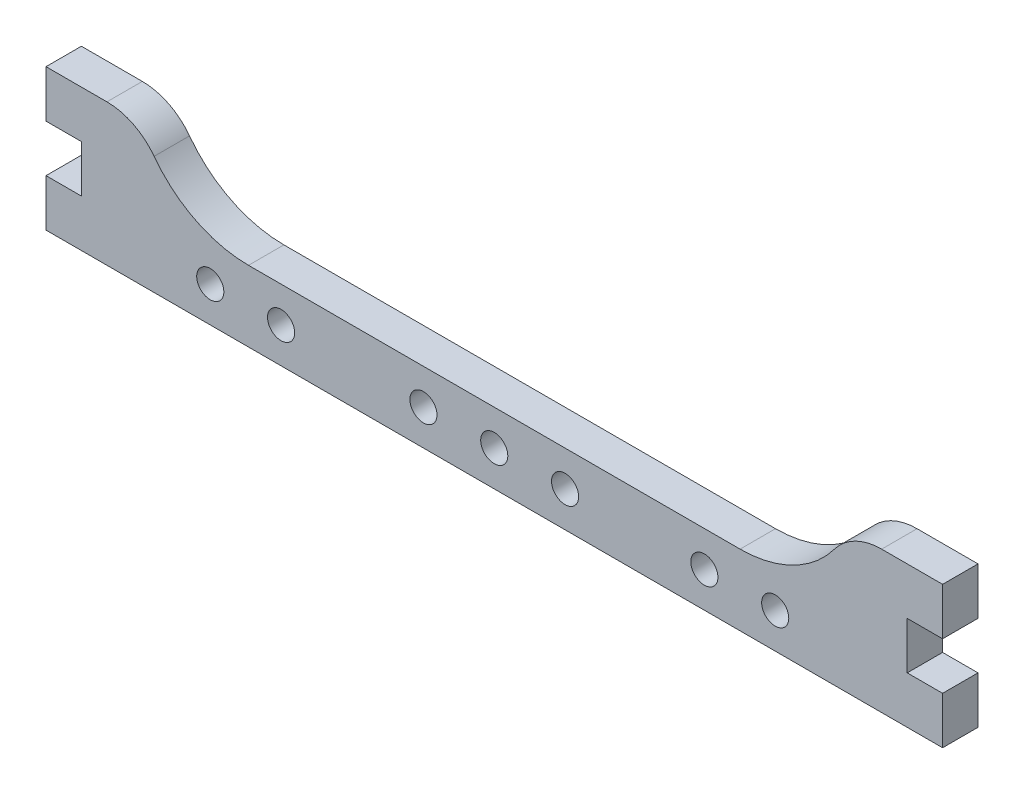
ISO-10303-21;
HEADER;
FILE_DESCRIPTION(('STEP AP214'),'2;1');
FILE_NAME('part.step','',(''),(''),'','','');
FILE_SCHEMA(('AUTOMOTIVE_DESIGN { 1 0 10303 214 1 1 1 1 }'));
ENDSEC;
DATA;
#1=APPLICATION_CONTEXT('core data for automotive mechanical design processes');
#2=APPLICATION_PROTOCOL_DEFINITION('international standard','automotive_design',2000,#1);
#3=PRODUCT_CONTEXT('',#1,'mechanical');
#4=PRODUCT('Part','Part','',(#3));
#5=PRODUCT_RELATED_PRODUCT_CATEGORY('part','',(#4));
#6=PRODUCT_DEFINITION_FORMATION('','',#4);
#7=PRODUCT_DEFINITION_CONTEXT('part definition',#1,'design');
#8=PRODUCT_DEFINITION('design','',#6,#7);
#9=PRODUCT_DEFINITION_SHAPE('','',#8);
#10=(LENGTH_UNIT() NAMED_UNIT(*) SI_UNIT(.MILLI.,.METRE.));
#11=(NAMED_UNIT(*) PLANE_ANGLE_UNIT() SI_UNIT($,.RADIAN.));
#12=(NAMED_UNIT(*) SI_UNIT($,.STERADIAN.) SOLID_ANGLE_UNIT());
#13=UNCERTAINTY_MEASURE_WITH_UNIT(LENGTH_MEASURE(1.E-05),#10,'distance_accuracy_value','');
#14=(GEOMETRIC_REPRESENTATION_CONTEXT(3) GLOBAL_UNCERTAINTY_ASSIGNED_CONTEXT((#13)) GLOBAL_UNIT_ASSIGNED_CONTEXT((#10,
#11,#12)) REPRESENTATION_CONTEXT('',''));
#15=CARTESIAN_POINT('',(0.,0.,0.));
#16=DIRECTION('',(0.,0.,1.));
#17=DIRECTION('',(1.,0.,0.));
#18=AXIS2_PLACEMENT_3D('',#15,#16,#17);
#19=CARTESIAN_POINT('',(-35.,12.,1.5));
#20=DIRECTION('',(0.,-1.,0.));
#21=DIRECTION('',(1.,0.,0.));
#22=AXIS2_PLACEMENT_3D('',#19,#20,#21);
#23=PLANE('',#22);
#24=DIRECTION('',(-1.,0.,0.));
#25=VECTOR('',#24,1.);
#26=CARTESIAN_POINT('',(-35.,12.,1.5));
#27=LINE('',#26,#25);
#28=CARTESIAN_POINT('',(-32.8348486100883,12.,1.5));
#29=VERTEX_POINT('',#28);
#30=CARTESIAN_POINT('',(-38.,12.,1.5));
#31=VERTEX_POINT('',#30);
#32=EDGE_CURVE('E271',#29,#31,#27,.T.);
#33=ORIENTED_EDGE('',*,*,#32,.F.);
#34=DIRECTION('',(0.,0.,1.));
#35=VECTOR('',#34,1.);
#36=CARTESIAN_POINT('',(-32.8348486100883,12.,1.5));
#37=LINE('',#36,#35);
#38=CARTESIAN_POINT('',(-32.8348486100883,12.,-1.5));
#39=VERTEX_POINT('',#38);
#40=EDGE_CURVE('E11',#29,#39,#37,.F.);
#41=ORIENTED_EDGE('',*,*,#40,.T.);
#42=DIRECTION('',(-1.,0.,0.));
#43=VECTOR('',#42,1.);
#44=CARTESIAN_POINT('',(-35.,12.,-1.5));
#45=LINE('',#44,#43);
#46=CARTESIAN_POINT('',(-38.,12.,-1.5));
#47=VERTEX_POINT('',#46);
#48=EDGE_CURVE('E167',#39,#47,#45,.T.);
#49=ORIENTED_EDGE('',*,*,#48,.T.);
#50=DIRECTION('',(0.,0.,1.));
#51=VECTOR('',#50,1.);
#52=CARTESIAN_POINT('',(-38.,12.,-1.5));
#53=LINE('',#52,#51);
#54=EDGE_CURVE('E170',#47,#31,#53,.T.);
#55=ORIENTED_EDGE('',*,*,#54,.T.);
#56=EDGE_LOOP('',(#33,#41,#49,#55));
#57=FACE_BOUND('',#56,.T.);
#58=ADVANCED_FACE('F39',(#57),#23,.F.);
#59=CARTESIAN_POINT('',(-35.,0.,1.5));
#60=DIRECTION('',(1.,0.,0.));
#61=DIRECTION('',(0.,0.,-1.));
#62=AXIS2_PLACEMENT_3D('',#59,#60,#61);
#63=PLANE('',#62);
#64=DIRECTION('',(0.,-1.,0.));
#65=VECTOR('',#64,1.);
#66=CARTESIAN_POINT('',(-35.,0.,1.5));
#67=LINE('',#66,#65);
#68=CARTESIAN_POINT('',(-35.,8.00000000000001,1.5));
#69=VERTEX_POINT('',#68);
#70=CARTESIAN_POINT('',(-35.,4.,1.5));
#71=VERTEX_POINT('',#70);
#72=EDGE_CURVE('E57',#69,#71,#67,.T.);
#73=ORIENTED_EDGE('',*,*,#72,.F.);
#74=DIRECTION('',(0.,0.,1.));
#75=VECTOR('',#74,1.);
#76=CARTESIAN_POINT('',(-35.,8.00000000000001,-1.5));
#77=LINE('',#76,#75);
#78=CARTESIAN_POINT('',(-35.,8.00000000000001,-1.5));
#79=VERTEX_POINT('',#78);
#80=EDGE_CURVE('E207',#79,#69,#77,.T.);
#81=ORIENTED_EDGE('',*,*,#80,.F.);
#82=DIRECTION('',(0.,-1.,0.));
#83=VECTOR('',#82,1.);
#84=CARTESIAN_POINT('',(-35.,0.,-1.5));
#85=LINE('',#84,#83);
#86=CARTESIAN_POINT('',(-35.,4.,-1.5));
#87=VERTEX_POINT('',#86);
#88=EDGE_CURVE('E246',#79,#87,#85,.T.);
#89=ORIENTED_EDGE('',*,*,#88,.T.);
#90=DIRECTION('',(0.,0.,1.));
#91=VECTOR('',#90,1.);
#92=CARTESIAN_POINT('',(-35.,4.,-1.5));
#93=LINE('',#92,#91);
#94=EDGE_CURVE('E217',#87,#71,#93,.T.);
#95=ORIENTED_EDGE('',*,*,#94,.T.);
#96=EDGE_LOOP('',(#73,#81,#89,#95));
#97=FACE_BOUND('',#96,.T.);
#98=ADVANCED_FACE('F431',(#97),#63,.F.);
#99=CARTESIAN_POINT('',(-35.,0.,1.5));
#100=DIRECTION('',(0.,1.,0.));
#101=DIRECTION('',(-1.,0.,0.));
#102=AXIS2_PLACEMENT_3D('',#99,#100,#101);
#103=PLANE('',#102);
#104=DIRECTION('',(1.,0.,0.));
#105=VECTOR('',#104,1.);
#106=CARTESIAN_POINT('',(-35.,0.,-1.5));
#107=LINE('',#106,#105);
#108=CARTESIAN_POINT('',(-38.,0.,-1.5));
#109=VERTEX_POINT('',#108);
#110=CARTESIAN_POINT('',(38.,0.,-1.5));
#111=VERTEX_POINT('',#110);
#112=EDGE_CURVE('E250',#109,#111,#107,.T.);
#113=ORIENTED_EDGE('',*,*,#112,.T.);
#114=DIRECTION('',(0.,0.,1.));
#115=VECTOR('',#114,1.);
#116=CARTESIAN_POINT('',(38.,0.,-1.5));
#117=LINE('',#116,#115);
#118=CARTESIAN_POINT('',(38.,0.,1.5));
#119=VERTEX_POINT('',#118);
#120=EDGE_CURVE('E345',#111,#119,#117,.T.);
#121=ORIENTED_EDGE('',*,*,#120,.T.);
#122=DIRECTION('',(1.,0.,0.));
#123=VECTOR('',#122,1.);
#124=CARTESIAN_POINT('',(-35.,0.,1.5));
#125=LINE('',#124,#123);
#126=CARTESIAN_POINT('',(-38.,0.,1.5));
#127=VERTEX_POINT('',#126);
#128=EDGE_CURVE('E272',#127,#119,#125,.T.);
#129=ORIENTED_EDGE('',*,*,#128,.F.);
#130=DIRECTION('',(0.,0.,1.));
#131=VECTOR('',#130,1.);
#132=CARTESIAN_POINT('',(-38.,0.,-1.5));
#133=LINE('',#132,#131);
#134=EDGE_CURVE('E223',#109,#127,#133,.T.);
#135=ORIENTED_EDGE('',*,*,#134,.F.);
#136=EDGE_LOOP('',(#113,#121,#129,#135));
#137=FACE_BOUND('',#136,.T.);
#138=ADVANCED_FACE('F436',(#137),#103,.F.);
#139=CARTESIAN_POINT('',(35.,0.,1.5));
#140=DIRECTION('',(-1.,0.,0.));
#141=DIRECTION('',(0.,0.,1.));
#142=AXIS2_PLACEMENT_3D('',#139,#140,#141);
#143=PLANE('',#142);
#144=DIRECTION('',(0.,1.,0.));
#145=VECTOR('',#144,1.);
#146=CARTESIAN_POINT('',(35.,0.,1.5));
#147=LINE('',#146,#145);
#148=CARTESIAN_POINT('',(35.,4.,1.5));
#149=VERTEX_POINT('',#148);
#150=CARTESIAN_POINT('',(35.,8.00000000000001,1.5));
#151=VERTEX_POINT('',#150);
#152=EDGE_CURVE('E269',#149,#151,#147,.T.);
#153=ORIENTED_EDGE('',*,*,#152,.F.);
#154=DIRECTION('',(0.,0.,1.));
#155=VECTOR('',#154,1.);
#156=CARTESIAN_POINT('',(35.,4.,-1.5));
#157=LINE('',#156,#155);
#158=CARTESIAN_POINT('',(35.,4.,-1.5));
#159=VERTEX_POINT('',#158);
#160=EDGE_CURVE('E316',#159,#149,#157,.T.);
#161=ORIENTED_EDGE('',*,*,#160,.F.);
#162=DIRECTION('',(0.,1.,0.));
#163=VECTOR('',#162,1.);
#164=CARTESIAN_POINT('',(35.,0.,-1.5));
#165=LINE('',#164,#163);
#166=CARTESIAN_POINT('',(35.,8.00000000000001,-1.5));
#167=VERTEX_POINT('',#166);
#168=EDGE_CURVE('E178',#159,#167,#165,.T.);
#169=ORIENTED_EDGE('',*,*,#168,.T.);
#170=DIRECTION('',(0.,0.,1.));
#171=VECTOR('',#170,1.);
#172=CARTESIAN_POINT('',(35.,8.00000000000001,-1.5));
#173=LINE('',#172,#171);
#174=EDGE_CURVE('E291',#167,#151,#173,.T.);
#175=ORIENTED_EDGE('',*,*,#174,.T.);
#176=EDGE_LOOP('',(#153,#161,#169,#175));
#177=FACE_BOUND('',#176,.T.);
#178=ADVANCED_FACE('F335',(#177),#143,.F.);
#179=CARTESIAN_POINT('',(38.,12.,-1.5));
#180=VERTEX_POINT('',#179);
#181=CARTESIAN_POINT('',(32.8348486100883,12.,-1.5));
#182=VERTEX_POINT('',#181);
#183=EDGE_CURVE('E177',#180,#182,#45,.T.);
#184=ORIENTED_EDGE('',*,*,#183,.T.);
#185=DIRECTION('',(0.,0.,-1.));
#186=VECTOR('',#185,1.);
#187=CARTESIAN_POINT('',(32.8348486100883,12.,1.5));
#188=LINE('',#187,#186);
#189=CARTESIAN_POINT('',(32.8348486100883,12.,1.5));
#190=VERTEX_POINT('',#189);
#191=EDGE_CURVE('E370',#182,#190,#188,.F.);
#192=ORIENTED_EDGE('',*,*,#191,.T.);
#193=CARTESIAN_POINT('',(38.,12.,1.5));
#194=VERTEX_POINT('',#193);
#195=EDGE_CURVE('E257',#194,#190,#27,.T.);
#196=ORIENTED_EDGE('',*,*,#195,.F.);
#197=DIRECTION('',(0.,0.,1.));
#198=VECTOR('',#197,1.);
#199=CARTESIAN_POINT('',(38.,12.,-1.5));
#200=LINE('',#199,#198);
#201=EDGE_CURVE('E282',#180,#194,#200,.T.);
#202=ORIENTED_EDGE('',*,*,#201,.F.);
#203=EDGE_LOOP('',(#184,#192,#196,#202));
#204=FACE_BOUND('',#203,.T.);
#205=ADVANCED_FACE('F369',(#204),#23,.F.);
#206=CARTESIAN_POINT('',(0.,0.,1.5));
#207=DIRECTION('',(0.,0.,-1.));
#208=DIRECTION('',(-1.,0.,0.));
#209=AXIS2_PLACEMENT_3D('',#206,#207,#208);
#210=PLANE('',#209);
#211=CARTESIAN_POINT('',(-24.0759562429866,2.99790958378771,1.5));
#212=DIRECTION('',(0.,0.,1.));
#213=DIRECTION('',(1.,0.,0.));
#214=AXIS2_PLACEMENT_3D('',#211,#212,#213);
#215=CIRCLE('',#214,1.15);
#216=CARTESIAN_POINT('',(-22.9259562429866,2.99790958378771,1.5));
#217=VERTEX_POINT('',#216);
#218=EDGE_CURVE('E520',#217,#217,#215,.T.);
#219=ORIENTED_EDGE('',*,*,#218,.F.);
#220=EDGE_LOOP('',(#219));
#221=FACE_BOUND('',#220,.T.);
#222=CARTESIAN_POINT('',(5.99818363191894,2.99789153114769,1.5));
#223=DIRECTION('',(0.,0.,1.));
#224=DIRECTION('',(1.,0.,0.));
#225=AXIS2_PLACEMENT_3D('',#222,#223,#224);
#226=CIRCLE('',#225,1.15);
#227=CARTESIAN_POINT('',(7.14818363191894,2.99789153114769,1.5));
#228=VERTEX_POINT('',#227);
#229=EDGE_CURVE('E537',#228,#228,#226,.T.);
#230=ORIENTED_EDGE('',*,*,#229,.F.);
#231=EDGE_LOOP('',(#230));
#232=FACE_BOUND('',#231,.T.);
#233=CARTESIAN_POINT('',(23.8098988836568,2.98731227019971,1.5));
#234=DIRECTION('',(0.,0.,1.));
#235=DIRECTION('',(1.,0.,0.));
#236=AXIS2_PLACEMENT_3D('',#233,#234,#235);
#237=CIRCLE('',#236,1.15);
#238=CARTESIAN_POINT('',(24.9598988836568,2.98731227019971,1.5));
#239=VERTEX_POINT('',#238);
#240=EDGE_CURVE('E533',#239,#239,#237,.T.);
#241=ORIENTED_EDGE('',*,*,#240,.F.);
#242=EDGE_LOOP('',(#241));
#243=FACE_BOUND('',#242,.T.);
#244=CARTESIAN_POINT('',(17.8061687344324,2.98942073905202,1.5));
#245=DIRECTION('',(0.,0.,1.));
#246=DIRECTION('',(1.,0.,0.));
#247=AXIS2_PLACEMENT_3D('',#244,#245,#246);
#248=CIRCLE('',#247,1.15);
#249=CARTESIAN_POINT('',(18.9561687344324,2.98942073905202,1.5));
#250=VERTEX_POINT('',#249);
#251=EDGE_CURVE('E202',#250,#250,#248,.T.);
#252=ORIENTED_EDGE('',*,*,#251,.F.);
#253=EDGE_LOOP('',(#252));
#254=FACE_BOUND('',#253,.T.);
#255=CARTESIAN_POINT('',(-0.00554651730550436,3.,1.5));
#256=DIRECTION('',(0.,0.,1.));
#257=DIRECTION('',(1.,0.,0.));
#258=AXIS2_PLACEMENT_3D('',#255,#256,#257);
#259=CIRCLE('',#258,1.15);
#260=CARTESIAN_POINT('',(1.1444534826945,3.,1.5));
#261=VERTEX_POINT('',#260);
#262=EDGE_CURVE('E543',#261,#261,#259,.T.);
#263=ORIENTED_EDGE('',*,*,#262,.F.);
#264=EDGE_LOOP('',(#263));
#265=FACE_BOUND('',#264,.T.);
#266=CARTESIAN_POINT('',(-6.00748816668952,2.99495443422052,1.5));
#267=DIRECTION('',(0.,0.,1.));
#268=DIRECTION('',(1.,0.,0.));
#269=AXIS2_PLACEMENT_3D('',#266,#267,#268);
#270=CIRCLE('',#269,1.15);
#271=CARTESIAN_POINT('',(-4.85748816668952,2.99495443422052,1.5));
#272=VERTEX_POINT('',#271);
#273=EDGE_CURVE('E530',#272,#272,#270,.T.);
#274=ORIENTED_EDGE('',*,*,#273,.F.);
#275=EDGE_LOOP('',(#274));
#276=FACE_BOUND('',#275,.T.);
#277=CARTESIAN_POINT('',(-18.0722260937621,2.9958011149354,1.5));
#278=DIRECTION('',(0.,0.,1.));
#279=DIRECTION('',(1.,0.,0.));
#280=AXIS2_PLACEMENT_3D('',#277,#278,#279);
#281=CIRCLE('',#280,1.15);
#282=CARTESIAN_POINT('',(-16.9222260937621,2.9958011149354,1.5));
#283=VERTEX_POINT('',#282);
#284=EDGE_CURVE('E523',#283,#283,#281,.T.);
#285=ORIENTED_EDGE('',*,*,#284,.F.);
#286=EDGE_LOOP('',(#285));
#287=FACE_BOUND('',#286,.T.);
#288=ORIENTED_EDGE('',*,*,#195,.T.);
#289=CARTESIAN_POINT('',(32.8348486100883,7.00000000000001,1.5));
#290=DIRECTION('',(0.,0.,-1.));
#291=DIRECTION('',(-1.,0.,0.));
#292=AXIS2_PLACEMENT_3D('',#289,#290,#291);
#293=CIRCLE('',#292,5.);
#294=CARTESIAN_POINT('',(28.8348486100883,10.,1.5));
#295=VERTEX_POINT('',#294);
#296=EDGE_CURVE('E390',#190,#295,#293,.F.);
#297=ORIENTED_EDGE('',*,*,#296,.T.);
#298=CARTESIAN_POINT('',(20.8348486100883,16.,1.5));
#299=DIRECTION('',(0.,0.,-1.));
#300=DIRECTION('',(-1.,0.,0.));
#301=AXIS2_PLACEMENT_3D('',#298,#299,#300);
#302=CIRCLE('',#301,10.);
#303=CARTESIAN_POINT('',(20.8348486100883,6.,1.5));
#304=VERTEX_POINT('',#303);
#305=EDGE_CURVE('E407',#295,#304,#302,.T.);
#306=ORIENTED_EDGE('',*,*,#305,.T.);
#307=DIRECTION('',(1.,0.,0.));
#308=VECTOR('',#307,1.);
#309=CARTESIAN_POINT('',(0.,6.,1.5));
#310=LINE('',#309,#308);
#311=CARTESIAN_POINT('',(-20.8348486100883,6.,1.5));
#312=VERTEX_POINT('',#311);
#313=EDGE_CURVE('E278',#312,#304,#310,.T.);
#314=ORIENTED_EDGE('',*,*,#313,.F.);
#315=CARTESIAN_POINT('',(-20.8348486100883,16.,1.5));
#316=DIRECTION('',(0.,0.,-1.));
#317=DIRECTION('',(-1.,0.,0.));
#318=AXIS2_PLACEMENT_3D('',#315,#316,#317);
#319=CIRCLE('',#318,10.);
#320=CARTESIAN_POINT('',(-28.8348486100883,10.,1.5));
#321=VERTEX_POINT('',#320);
#322=EDGE_CURVE('E398',#312,#321,#319,.T.);
#323=ORIENTED_EDGE('',*,*,#322,.T.);
#324=CARTESIAN_POINT('',(-32.8348486100883,7.,1.5));
#325=DIRECTION('',(0.,0.,-1.));
#326=DIRECTION('',(-1.,0.,0.));
#327=AXIS2_PLACEMENT_3D('',#324,#325,#326);
#328=CIRCLE('',#327,5.);
#329=EDGE_CURVE('E378',#321,#29,#328,.F.);
#330=ORIENTED_EDGE('',*,*,#329,.T.);
#331=ORIENTED_EDGE('',*,*,#32,.T.);
#332=DIRECTION('',(0.,-1.,0.));
#333=VECTOR('',#332,1.);
#334=CARTESIAN_POINT('',(-38.,12.,1.5));
#335=LINE('',#334,#333);
#336=CARTESIAN_POINT('',(-38.,8.00000000000001,1.5));
#337=VERTEX_POINT('',#336);
#338=EDGE_CURVE('E185',#31,#337,#335,.T.);
#339=ORIENTED_EDGE('',*,*,#338,.T.);
#340=DIRECTION('',(1.,0.,0.));
#341=VECTOR('',#340,1.);
#342=CARTESIAN_POINT('',(-35.,8.00000000000001,1.5));
#343=LINE('',#342,#341);
#344=EDGE_CURVE('E195',#337,#69,#343,.T.);
#345=ORIENTED_EDGE('',*,*,#344,.T.);
#346=ORIENTED_EDGE('',*,*,#72,.T.);
#347=DIRECTION('',(-1.,0.,0.));
#348=VECTOR('',#347,1.);
#349=CARTESIAN_POINT('',(-35.,4.,1.5));
#350=LINE('',#349,#348);
#351=CARTESIAN_POINT('',(-38.,4.,1.5));
#352=VERTEX_POINT('',#351);
#353=EDGE_CURVE('E210',#71,#352,#350,.T.);
#354=ORIENTED_EDGE('',*,*,#353,.T.);
#355=DIRECTION('',(0.,-1.,0.));
#356=VECTOR('',#355,1.);
#357=CARTESIAN_POINT('',(-38.,0.,1.5));
#358=LINE('',#357,#356);
#359=EDGE_CURVE('E219',#352,#127,#358,.T.);
#360=ORIENTED_EDGE('',*,*,#359,.T.);
#361=ORIENTED_EDGE('',*,*,#128,.T.);
#362=DIRECTION('',(0.,1.,0.));
#363=VECTOR('',#362,1.);
#364=CARTESIAN_POINT('',(38.,0.,1.5));
#365=LINE('',#364,#363);
#366=CARTESIAN_POINT('',(38.,4.,1.5));
#367=VERTEX_POINT('',#366);
#368=EDGE_CURVE('E227',#119,#367,#365,.T.);
#369=ORIENTED_EDGE('',*,*,#368,.T.);
#370=DIRECTION('',(-1.,0.,0.));
#371=VECTOR('',#370,1.);
#372=CARTESIAN_POINT('',(35.,4.,1.5));
#373=LINE('',#372,#371);
#374=EDGE_CURVE('E331',#367,#149,#373,.T.);
#375=ORIENTED_EDGE('',*,*,#374,.T.);
#376=ORIENTED_EDGE('',*,*,#152,.T.);
#377=DIRECTION('',(1.,0.,0.));
#378=VECTOR('',#377,1.);
#379=CARTESIAN_POINT('',(35.,8.00000000000001,1.5));
#380=LINE('',#379,#378);
#381=CARTESIAN_POINT('',(38.,8.00000000000001,1.5));
#382=VERTEX_POINT('',#381);
#383=EDGE_CURVE('E310',#151,#382,#380,.T.);
#384=ORIENTED_EDGE('',*,*,#383,.T.);
#385=DIRECTION('',(0.,1.,0.));
#386=VECTOR('',#385,1.);
#387=CARTESIAN_POINT('',(38.,12.,1.5));
#388=LINE('',#387,#386);
#389=EDGE_CURVE('E301',#382,#194,#388,.T.);
#390=ORIENTED_EDGE('',*,*,#389,.T.);
#391=EDGE_LOOP('',(#288,#297,#306,#314,#323,#330,#331,#339,#345,#346,#354,#360,#361,#369,#375,
#376,#384,#390));
#392=FACE_BOUND('',#391,.T.);
#393=ADVANCED_FACE('F327',(#221,#232,#243,#254,#265,#276,#287,#392),#210,.F.);
#394=CARTESIAN_POINT('',(0.,0.,-1.5));
#395=DIRECTION('',(0.,0.,-1.));
#396=DIRECTION('',(-1.,0.,0.));
#397=AXIS2_PLACEMENT_3D('',#394,#395,#396);
#398=PLANE('',#397);
#399=CARTESIAN_POINT('',(-24.0759562429866,2.99790958378771,-1.5));
#400=DIRECTION('',(0.,0.,-1.));
#401=DIRECTION('',(-1.,0.,0.));
#402=AXIS2_PLACEMENT_3D('',#399,#400,#401);
#403=CIRCLE('',#402,1.15);
#404=CARTESIAN_POINT('',(-25.2259562429866,2.99790958378771,-1.5));
#405=VERTEX_POINT('',#404);
#406=EDGE_CURVE('E43',#405,#405,#403,.T.);
#407=ORIENTED_EDGE('',*,*,#406,.F.);
#408=EDGE_LOOP('',(#407));
#409=FACE_BOUND('',#408,.T.);
#410=CARTESIAN_POINT('',(5.99818363191894,2.99789153114769,-1.5));
#411=DIRECTION('',(0.,0.,-1.));
#412=DIRECTION('',(-1.,0.,0.));
#413=AXIS2_PLACEMENT_3D('',#410,#411,#412);
#414=CIRCLE('',#413,1.15);
#415=CARTESIAN_POINT('',(4.84818363191894,2.99789153114769,-1.5));
#416=VERTEX_POINT('',#415);
#417=EDGE_CURVE('E582',#416,#416,#414,.T.);
#418=ORIENTED_EDGE('',*,*,#417,.F.);
#419=EDGE_LOOP('',(#418));
#420=FACE_BOUND('',#419,.T.);
#421=CARTESIAN_POINT('',(23.8098988836568,2.98731227019971,-1.5));
#422=DIRECTION('',(0.,0.,-1.));
#423=DIRECTION('',(-1.,0.,0.));
#424=AXIS2_PLACEMENT_3D('',#421,#422,#423);
#425=CIRCLE('',#424,1.15);
#426=CARTESIAN_POINT('',(22.6598988836568,2.98731227019971,-1.5));
#427=VERTEX_POINT('',#426);
#428=EDGE_CURVE('E579',#427,#427,#425,.T.);
#429=ORIENTED_EDGE('',*,*,#428,.F.);
#430=EDGE_LOOP('',(#429));
#431=FACE_BOUND('',#430,.T.);
#432=CARTESIAN_POINT('',(17.8061687344324,2.98942073905202,-1.5));
#433=DIRECTION('',(0.,0.,-1.));
#434=DIRECTION('',(-1.,0.,0.));
#435=AXIS2_PLACEMENT_3D('',#432,#433,#434);
#436=CIRCLE('',#435,1.15);
#437=CARTESIAN_POINT('',(16.6561687344324,2.98942073905202,-1.5));
#438=VERTEX_POINT('',#437);
#439=EDGE_CURVE('E575',#438,#438,#436,.T.);
#440=ORIENTED_EDGE('',*,*,#439,.F.);
#441=EDGE_LOOP('',(#440));
#442=FACE_BOUND('',#441,.T.);
#443=CARTESIAN_POINT('',(-0.00554651730550436,3.,-1.5));
#444=DIRECTION('',(0.,0.,-1.));
#445=DIRECTION('',(-1.,0.,0.));
#446=AXIS2_PLACEMENT_3D('',#443,#444,#445);
#447=CIRCLE('',#446,1.15);
#448=CARTESIAN_POINT('',(-1.1555465173055,3.,-1.5));
#449=VERTEX_POINT('',#448);
#450=EDGE_CURVE('E569',#449,#449,#447,.T.);
#451=ORIENTED_EDGE('',*,*,#450,.F.);
#452=EDGE_LOOP('',(#451));
#453=FACE_BOUND('',#452,.T.);
#454=CARTESIAN_POINT('',(-6.00748816668952,2.99495443422052,-1.5));
#455=DIRECTION('',(0.,0.,-1.));
#456=DIRECTION('',(-1.,0.,0.));
#457=AXIS2_PLACEMENT_3D('',#454,#455,#456);
#458=CIRCLE('',#457,1.15);
#459=CARTESIAN_POINT('',(-7.15748816668952,2.99495443422052,-1.5));
#460=VERTEX_POINT('',#459);
#461=EDGE_CURVE('E528',#460,#460,#458,.T.);
#462=ORIENTED_EDGE('',*,*,#461,.F.);
#463=EDGE_LOOP('',(#462));
#464=FACE_BOUND('',#463,.T.);
#465=CARTESIAN_POINT('',(-18.0722260937621,2.9958011149354,-1.5));
#466=DIRECTION('',(0.,0.,-1.));
#467=DIRECTION('',(-1.,0.,0.));
#468=AXIS2_PLACEMENT_3D('',#465,#466,#467);
#469=CIRCLE('',#468,1.15);
#470=CARTESIAN_POINT('',(-19.2222260937621,2.9958011149354,-1.5));
#471=VERTEX_POINT('',#470);
#472=EDGE_CURVE('E522',#471,#471,#469,.T.);
#473=ORIENTED_EDGE('',*,*,#472,.F.);
#474=EDGE_LOOP('',(#473));
#475=FACE_BOUND('',#474,.T.);
#476=CARTESIAN_POINT('',(20.8348486100883,16.,-1.5));
#477=DIRECTION('',(0.,0.,-1.));
#478=DIRECTION('',(-1.,0.,0.));
#479=AXIS2_PLACEMENT_3D('',#476,#477,#478);
#480=CIRCLE('',#479,10.);
#481=CARTESIAN_POINT('',(20.8348486100883,6.,-1.5));
#482=VERTEX_POINT('',#481);
#483=CARTESIAN_POINT('',(28.8348486100883,10.,-1.5));
#484=VERTEX_POINT('',#483);
#485=EDGE_CURVE('E402',#482,#484,#480,.F.);
#486=ORIENTED_EDGE('',*,*,#485,.T.);
#487=CARTESIAN_POINT('',(32.8348486100883,7.00000000000001,-1.5));
#488=DIRECTION('',(0.,0.,-1.));
#489=DIRECTION('',(-1.,0.,0.));
#490=AXIS2_PLACEMENT_3D('',#487,#488,#489);
#491=CIRCLE('',#490,5.);
#492=EDGE_CURVE('E364',#484,#182,#491,.T.);
#493=ORIENTED_EDGE('',*,*,#492,.T.);
#494=ORIENTED_EDGE('',*,*,#183,.F.);
#495=DIRECTION('',(0.,1.,0.));
#496=VECTOR('',#495,1.);
#497=CARTESIAN_POINT('',(38.,12.,-1.5));
#498=LINE('',#497,#496);
#499=CARTESIAN_POINT('',(38.,8.00000000000001,-1.5));
#500=VERTEX_POINT('',#499);
#501=EDGE_CURVE('E295',#500,#180,#498,.T.);
#502=ORIENTED_EDGE('',*,*,#501,.F.);
#503=DIRECTION('',(1.,0.,0.));
#504=VECTOR('',#503,1.);
#505=CARTESIAN_POINT('',(35.,8.00000000000001,-1.5));
#506=LINE('',#505,#504);
#507=EDGE_CURVE('E298',#167,#500,#506,.T.);
#508=ORIENTED_EDGE('',*,*,#507,.F.);
#509=ORIENTED_EDGE('',*,*,#168,.F.);
#510=DIRECTION('',(-1.,0.,0.));
#511=VECTOR('',#510,1.);
#512=CARTESIAN_POINT('',(35.,4.,-1.5));
#513=LINE('',#512,#511);
#514=CARTESIAN_POINT('',(38.,4.,-1.5));
#515=VERTEX_POINT('',#514);
#516=EDGE_CURVE('E340',#515,#159,#513,.T.);
#517=ORIENTED_EDGE('',*,*,#516,.F.);
#518=DIRECTION('',(0.,1.,0.));
#519=VECTOR('',#518,1.);
#520=CARTESIAN_POINT('',(38.,0.,-1.5));
#521=LINE('',#520,#519);
#522=EDGE_CURVE('E233',#111,#515,#521,.T.);
#523=ORIENTED_EDGE('',*,*,#522,.F.);
#524=ORIENTED_EDGE('',*,*,#112,.F.);
#525=DIRECTION('',(0.,-1.,0.));
#526=VECTOR('',#525,1.);
#527=CARTESIAN_POINT('',(-38.,0.,-1.5));
#528=LINE('',#527,#526);
#529=CARTESIAN_POINT('',(-38.,4.,-1.5));
#530=VERTEX_POINT('',#529);
#531=EDGE_CURVE('E213',#530,#109,#528,.T.);
#532=ORIENTED_EDGE('',*,*,#531,.F.);
#533=DIRECTION('',(-1.,0.,0.));
#534=VECTOR('',#533,1.);
#535=CARTESIAN_POINT('',(-35.,4.,-1.5));
#536=LINE('',#535,#534);
#537=EDGE_CURVE('E218',#87,#530,#536,.T.);
#538=ORIENTED_EDGE('',*,*,#537,.F.);
#539=ORIENTED_EDGE('',*,*,#88,.F.);
#540=DIRECTION('',(1.,0.,0.));
#541=VECTOR('',#540,1.);
#542=CARTESIAN_POINT('',(-35.,8.00000000000001,-1.5));
#543=LINE('',#542,#541);
#544=CARTESIAN_POINT('',(-38.,8.00000000000001,-1.5));
#545=VERTEX_POINT('',#544);
#546=EDGE_CURVE('E188',#545,#79,#543,.T.);
#547=ORIENTED_EDGE('',*,*,#546,.F.);
#548=DIRECTION('',(0.,-1.,0.));
#549=VECTOR('',#548,1.);
#550=CARTESIAN_POINT('',(-38.,12.,-1.5));
#551=LINE('',#550,#549);
#552=EDGE_CURVE('E183',#47,#545,#551,.T.);
#553=ORIENTED_EDGE('',*,*,#552,.F.);
#554=ORIENTED_EDGE('',*,*,#48,.F.);
#555=CARTESIAN_POINT('',(-32.8348486100883,7.,-1.5));
#556=DIRECTION('',(0.,0.,-1.));
#557=DIRECTION('',(-1.,0.,0.));
#558=AXIS2_PLACEMENT_3D('',#555,#556,#557);
#559=CIRCLE('',#558,5.);
#560=CARTESIAN_POINT('',(-28.8348486100883,10.,-1.5));
#561=VERTEX_POINT('',#560);
#562=EDGE_CURVE('E382',#39,#561,#559,.T.);
#563=ORIENTED_EDGE('',*,*,#562,.T.);
#564=CARTESIAN_POINT('',(-20.8348486100883,16.,-1.5));
#565=DIRECTION('',(0.,0.,-1.));
#566=DIRECTION('',(-1.,0.,0.));
#567=AXIS2_PLACEMENT_3D('',#564,#565,#566);
#568=CIRCLE('',#567,10.);
#569=CARTESIAN_POINT('',(-20.8348486100883,6.,-1.5));
#570=VERTEX_POINT('',#569);
#571=EDGE_CURVE('E399',#561,#570,#568,.F.);
#572=ORIENTED_EDGE('',*,*,#571,.T.);
#573=DIRECTION('',(1.,0.,0.));
#574=VECTOR('',#573,1.);
#575=CARTESIAN_POINT('',(0.,6.,-1.5));
#576=LINE('',#575,#574);
#577=EDGE_CURVE('E251',#570,#482,#576,.T.);
#578=ORIENTED_EDGE('',*,*,#577,.T.);
#579=EDGE_LOOP('',(#486,#493,#494,#502,#508,#509,#517,#523,#524,#532,#538,#539,#547,#553,#554,
#563,#572,#578));
#580=FACE_BOUND('',#579,.T.);
#581=ADVANCED_FACE('F192',(#409,#420,#431,#442,#453,#464,#475,#580),#398,.T.);
#582=CARTESIAN_POINT('',(0.,6.,-1.5));
#583=DIRECTION('',(0.,-1.,0.));
#584=DIRECTION('',(0.,0.,-1.));
#585=AXIS2_PLACEMENT_3D('',#582,#583,#584);
#586=PLANE('',#585);
#587=ORIENTED_EDGE('',*,*,#313,.T.);
#588=DIRECTION('',(0.,0.,-1.));
#589=VECTOR('',#588,1.);
#590=CARTESIAN_POINT('',(20.8348486100883,6.,-1.5));
#591=LINE('',#590,#589);
#592=EDGE_CURVE('E376',#304,#482,#591,.T.);
#593=ORIENTED_EDGE('',*,*,#592,.T.);
#594=ORIENTED_EDGE('',*,*,#577,.F.);
#595=DIRECTION('',(0.,0.,1.));
#596=VECTOR('',#595,1.);
#597=CARTESIAN_POINT('',(-20.8348486100883,6.,-1.5));
#598=LINE('',#597,#596);
#599=EDGE_CURVE('E372',#570,#312,#598,.T.);
#600=ORIENTED_EDGE('',*,*,#599,.T.);
#601=EDGE_LOOP('',(#587,#593,#594,#600));
#602=FACE_BOUND('',#601,.T.);
#603=ADVANCED_FACE('F453',(#602),#586,.F.);
#604=CARTESIAN_POINT('',(20.8348486100883,16.,-1.5));
#605=DIRECTION('',(0.,0.,-1.));
#606=DIRECTION('',(-1.,0.,0.));
#607=AXIS2_PLACEMENT_3D('',#604,#605,#606);
#608=CYLINDRICAL_SURFACE('',#607,10.);
#609=ORIENTED_EDGE('',*,*,#305,.F.);
#610=DIRECTION('',(0.,0.,-1.));
#611=VECTOR('',#610,1.);
#612=CARTESIAN_POINT('',(28.8348486100883,10.,-1.5));
#613=LINE('',#612,#611);
#614=EDGE_CURVE('E385',#295,#484,#613,.T.);
#615=ORIENTED_EDGE('',*,*,#614,.T.);
#616=ORIENTED_EDGE('',*,*,#485,.F.);
#617=ORIENTED_EDGE('',*,*,#592,.F.);
#618=EDGE_LOOP('',(#609,#615,#616,#617));
#619=FACE_BOUND('',#618,.T.);
#620=ADVANCED_FACE('F420',(#619),#608,.F.);
#621=CARTESIAN_POINT('',(-20.8348486100883,16.,-1.5));
#622=DIRECTION('',(0.,0.,1.));
#623=DIRECTION('',(1.,0.,0.));
#624=AXIS2_PLACEMENT_3D('',#621,#622,#623);
#625=CYLINDRICAL_SURFACE('',#624,10.);
#626=ORIENTED_EDGE('',*,*,#571,.F.);
#627=DIRECTION('',(0.,0.,1.));
#628=VECTOR('',#627,1.);
#629=CARTESIAN_POINT('',(-28.8348486100883,10.,-1.5));
#630=LINE('',#629,#628);
#631=EDGE_CURVE('E49',#561,#321,#630,.T.);
#632=ORIENTED_EDGE('',*,*,#631,.T.);
#633=ORIENTED_EDGE('',*,*,#322,.F.);
#634=ORIENTED_EDGE('',*,*,#599,.F.);
#635=EDGE_LOOP('',(#626,#632,#633,#634));
#636=FACE_BOUND('',#635,.T.);
#637=ADVANCED_FACE('F396',(#636),#625,.F.);
#638=CARTESIAN_POINT('',(32.8348486100883,7.00000000000001,-1.5));
#639=DIRECTION('',(0.,0.,-1.));
#640=DIRECTION('',(-1.,0.,0.));
#641=AXIS2_PLACEMENT_3D('',#638,#639,#640);
#642=CYLINDRICAL_SURFACE('',#641,5.);
#643=ORIENTED_EDGE('',*,*,#492,.F.);
#644=ORIENTED_EDGE('',*,*,#614,.F.);
#645=ORIENTED_EDGE('',*,*,#296,.F.);
#646=ORIENTED_EDGE('',*,*,#191,.F.);
#647=EDGE_LOOP('',(#643,#644,#645,#646));
#648=FACE_BOUND('',#647,.T.);
#649=ADVANCED_FACE('F423',(#648),#642,.T.);
#650=CARTESIAN_POINT('',(-32.8348486100883,7.,-1.5));
#651=DIRECTION('',(0.,0.,1.));
#652=DIRECTION('',(1.,0.,0.));
#653=AXIS2_PLACEMENT_3D('',#650,#651,#652);
#654=CYLINDRICAL_SURFACE('',#653,5.);
#655=ORIENTED_EDGE('',*,*,#562,.F.);
#656=ORIENTED_EDGE('',*,*,#40,.F.);
#657=ORIENTED_EDGE('',*,*,#329,.F.);
#658=ORIENTED_EDGE('',*,*,#631,.F.);
#659=EDGE_LOOP('',(#655,#656,#657,#658));
#660=FACE_BOUND('',#659,.T.);
#661=ADVANCED_FACE('F41',(#660),#654,.T.);
#662=CARTESIAN_POINT('',(38.,12.,-1.5));
#663=DIRECTION('',(1.,0.,0.));
#664=DIRECTION('',(0.,0.,-1.));
#665=AXIS2_PLACEMENT_3D('',#662,#663,#664);
#666=PLANE('',#665);
#667=ORIENTED_EDGE('',*,*,#389,.F.);
#668=DIRECTION('',(0.,0.,1.));
#669=VECTOR('',#668,1.);
#670=CARTESIAN_POINT('',(38.,8.00000000000001,-1.5));
#671=LINE('',#670,#669);
#672=EDGE_CURVE('E288',#500,#382,#671,.T.);
#673=ORIENTED_EDGE('',*,*,#672,.F.);
#674=ORIENTED_EDGE('',*,*,#501,.T.);
#675=ORIENTED_EDGE('',*,*,#201,.T.);
#676=EDGE_LOOP('',(#667,#673,#674,#675));
#677=FACE_BOUND('',#676,.T.);
#678=ADVANCED_FACE('F326',(#677),#666,.T.);
#679=CARTESIAN_POINT('',(35.,8.00000000000001,-1.5));
#680=DIRECTION('',(0.,-1.,0.));
#681=DIRECTION('',(1.,0.,0.));
#682=AXIS2_PLACEMENT_3D('',#679,#680,#681);
#683=PLANE('',#682);
#684=ORIENTED_EDGE('',*,*,#383,.F.);
#685=ORIENTED_EDGE('',*,*,#174,.F.);
#686=ORIENTED_EDGE('',*,*,#507,.T.);
#687=ORIENTED_EDGE('',*,*,#672,.T.);
#688=EDGE_LOOP('',(#684,#685,#686,#687));
#689=FACE_BOUND('',#688,.T.);
#690=ADVANCED_FACE('F324',(#689),#683,.T.);
#691=CARTESIAN_POINT('',(35.,4.,-1.5));
#692=DIRECTION('',(0.,1.,0.));
#693=DIRECTION('',(0.,0.,1.));
#694=AXIS2_PLACEMENT_3D('',#691,#692,#693);
#695=PLANE('',#694);
#696=ORIENTED_EDGE('',*,*,#374,.F.);
#697=DIRECTION('',(0.,0.,1.));
#698=VECTOR('',#697,1.);
#699=CARTESIAN_POINT('',(38.,4.,-1.5));
#700=LINE('',#699,#698);
#701=EDGE_CURVE('E342',#515,#367,#700,.T.);
#702=ORIENTED_EDGE('',*,*,#701,.F.);
#703=ORIENTED_EDGE('',*,*,#516,.T.);
#704=ORIENTED_EDGE('',*,*,#160,.T.);
#705=EDGE_LOOP('',(#696,#702,#703,#704));
#706=FACE_BOUND('',#705,.T.);
#707=ADVANCED_FACE('F338',(#706),#695,.T.);
#708=CARTESIAN_POINT('',(38.,0.,-1.5));
#709=DIRECTION('',(1.,0.,0.));
#710=DIRECTION('',(0.,0.,-1.));
#711=AXIS2_PLACEMENT_3D('',#708,#709,#710);
#712=PLANE('',#711);
#713=ORIENTED_EDGE('',*,*,#368,.F.);
#714=ORIENTED_EDGE('',*,*,#120,.F.);
#715=ORIENTED_EDGE('',*,*,#522,.T.);
#716=ORIENTED_EDGE('',*,*,#701,.T.);
#717=EDGE_LOOP('',(#713,#714,#715,#716));
#718=FACE_BOUND('',#717,.T.);
#719=ADVANCED_FACE('F360',(#718),#712,.T.);
#720=CARTESIAN_POINT('',(-38.,0.,-1.5));
#721=DIRECTION('',(-1.,0.,0.));
#722=DIRECTION('',(0.,0.,1.));
#723=AXIS2_PLACEMENT_3D('',#720,#721,#722);
#724=PLANE('',#723);
#725=ORIENTED_EDGE('',*,*,#359,.F.);
#726=DIRECTION('',(0.,0.,1.));
#727=VECTOR('',#726,1.);
#728=CARTESIAN_POINT('',(-38.,4.,-1.5));
#729=LINE('',#728,#727);
#730=EDGE_CURVE('E228',#530,#352,#729,.T.);
#731=ORIENTED_EDGE('',*,*,#730,.F.);
#732=ORIENTED_EDGE('',*,*,#531,.T.);
#733=ORIENTED_EDGE('',*,*,#134,.T.);
#734=EDGE_LOOP('',(#725,#731,#732,#733));
#735=FACE_BOUND('',#734,.T.);
#736=ADVANCED_FACE('F470',(#735),#724,.T.);
#737=CARTESIAN_POINT('',(-35.,4.,-1.5));
#738=DIRECTION('',(0.,1.,0.));
#739=DIRECTION('',(0.,0.,1.));
#740=AXIS2_PLACEMENT_3D('',#737,#738,#739);
#741=PLANE('',#740);
#742=ORIENTED_EDGE('',*,*,#353,.F.);
#743=ORIENTED_EDGE('',*,*,#94,.F.);
#744=ORIENTED_EDGE('',*,*,#537,.T.);
#745=ORIENTED_EDGE('',*,*,#730,.T.);
#746=EDGE_LOOP('',(#742,#743,#744,#745));
#747=FACE_BOUND('',#746,.T.);
#748=ADVANCED_FACE('F473',(#747),#741,.T.);
#749=CARTESIAN_POINT('',(-35.,8.00000000000001,-1.5));
#750=DIRECTION('',(0.,-1.,0.));
#751=DIRECTION('',(1.,0.,0.));
#752=AXIS2_PLACEMENT_3D('',#749,#750,#751);
#753=PLANE('',#752);
#754=ORIENTED_EDGE('',*,*,#344,.F.);
#755=DIRECTION('',(0.,0.,1.));
#756=VECTOR('',#755,1.);
#757=CARTESIAN_POINT('',(-38.,8.00000000000001,-1.5));
#758=LINE('',#757,#756);
#759=EDGE_CURVE('E187',#545,#337,#758,.T.);
#760=ORIENTED_EDGE('',*,*,#759,.F.);
#761=ORIENTED_EDGE('',*,*,#546,.T.);
#762=ORIENTED_EDGE('',*,*,#80,.T.);
#763=EDGE_LOOP('',(#754,#760,#761,#762));
#764=FACE_BOUND('',#763,.T.);
#765=ADVANCED_FACE('F476',(#764),#753,.T.);
#766=CARTESIAN_POINT('',(-38.,12.,-1.5));
#767=DIRECTION('',(-1.,0.,0.));
#768=DIRECTION('',(0.,0.,1.));
#769=AXIS2_PLACEMENT_3D('',#766,#767,#768);
#770=PLANE('',#769);
#771=ORIENTED_EDGE('',*,*,#338,.F.);
#772=ORIENTED_EDGE('',*,*,#54,.F.);
#773=ORIENTED_EDGE('',*,*,#552,.T.);
#774=ORIENTED_EDGE('',*,*,#759,.T.);
#775=EDGE_LOOP('',(#771,#772,#773,#774));
#776=FACE_BOUND('',#775,.T.);
#777=ADVANCED_FACE('F182',(#776),#770,.T.);
#778=CARTESIAN_POINT('',(-18.0722260937621,2.9958011149354,-8.5));
#779=DIRECTION('',(0.,0.,1.));
#780=DIRECTION('',(1.,0.,0.));
#781=AXIS2_PLACEMENT_3D('',#778,#779,#780);
#782=CYLINDRICAL_SURFACE('',#781,1.15);
#783=ORIENTED_EDGE('',*,*,#472,.T.);
#784=EDGE_LOOP('',(#783));
#785=FACE_BOUND('',#784,.T.);
#786=ORIENTED_EDGE('',*,*,#284,.T.);
#787=EDGE_LOOP('',(#786));
#788=FACE_BOUND('',#787,.T.);
#789=ADVANCED_FACE('F483',(#785,#788),#782,.F.);
#790=CARTESIAN_POINT('',(-6.00748816668952,2.99495443422052,-8.5));
#791=DIRECTION('',(0.,0.,1.));
#792=DIRECTION('',(1.,0.,0.));
#793=AXIS2_PLACEMENT_3D('',#790,#791,#792);
#794=CYLINDRICAL_SURFACE('',#793,1.15);
#795=ORIENTED_EDGE('',*,*,#461,.T.);
#796=EDGE_LOOP('',(#795));
#797=FACE_BOUND('',#796,.T.);
#798=ORIENTED_EDGE('',*,*,#273,.T.);
#799=EDGE_LOOP('',(#798));
#800=FACE_BOUND('',#799,.T.);
#801=ADVANCED_FACE('F495',(#797,#800),#794,.F.);
#802=CARTESIAN_POINT('',(-0.00554651730550436,3.,-8.5));
#803=DIRECTION('',(0.,0.,1.));
#804=DIRECTION('',(1.,0.,0.));
#805=AXIS2_PLACEMENT_3D('',#802,#803,#804);
#806=CYLINDRICAL_SURFACE('',#805,1.15);
#807=ORIENTED_EDGE('',*,*,#450,.T.);
#808=EDGE_LOOP('',(#807));
#809=FACE_BOUND('',#808,.T.);
#810=ORIENTED_EDGE('',*,*,#262,.T.);
#811=EDGE_LOOP('',(#810));
#812=FACE_BOUND('',#811,.T.);
#813=ADVANCED_FACE('F491',(#809,#812),#806,.F.);
#814=CARTESIAN_POINT('',(17.8061687344324,2.98942073905202,-8.5));
#815=DIRECTION('',(0.,0.,1.));
#816=DIRECTION('',(1.,0.,0.));
#817=AXIS2_PLACEMENT_3D('',#814,#815,#816);
#818=CYLINDRICAL_SURFACE('',#817,1.15);
#819=ORIENTED_EDGE('',*,*,#439,.T.);
#820=EDGE_LOOP('',(#819));
#821=FACE_BOUND('',#820,.T.);
#822=ORIENTED_EDGE('',*,*,#251,.T.);
#823=EDGE_LOOP('',(#822));
#824=FACE_BOUND('',#823,.T.);
#825=ADVANCED_FACE('F487',(#821,#824),#818,.F.);
#826=CARTESIAN_POINT('',(23.8098988836568,2.98731227019971,-8.5));
#827=DIRECTION('',(0.,0.,1.));
#828=DIRECTION('',(1.,0.,0.));
#829=AXIS2_PLACEMENT_3D('',#826,#827,#828);
#830=CYLINDRICAL_SURFACE('',#829,1.15);
#831=ORIENTED_EDGE('',*,*,#428,.T.);
#832=EDGE_LOOP('',(#831));
#833=FACE_BOUND('',#832,.T.);
#834=ORIENTED_EDGE('',*,*,#240,.T.);
#835=EDGE_LOOP('',(#834));
#836=FACE_BOUND('',#835,.T.);
#837=ADVANCED_FACE('F490',(#833,#836),#830,.F.);
#838=CARTESIAN_POINT('',(5.99818363191894,2.99789153114769,-8.5));
#839=DIRECTION('',(0.,0.,1.));
#840=DIRECTION('',(1.,0.,0.));
#841=AXIS2_PLACEMENT_3D('',#838,#839,#840);
#842=CYLINDRICAL_SURFACE('',#841,1.15);
#843=ORIENTED_EDGE('',*,*,#417,.T.);
#844=EDGE_LOOP('',(#843));
#845=FACE_BOUND('',#844,.T.);
#846=ORIENTED_EDGE('',*,*,#229,.T.);
#847=EDGE_LOOP('',(#846));
#848=FACE_BOUND('',#847,.T.);
#849=ADVANCED_FACE('F503',(#845,#848),#842,.F.);
#850=CARTESIAN_POINT('',(-24.0759562429866,2.99790958378771,-8.5));
#851=DIRECTION('',(0.,0.,1.));
#852=DIRECTION('',(1.,0.,0.));
#853=AXIS2_PLACEMENT_3D('',#850,#851,#852);
#854=CYLINDRICAL_SURFACE('',#853,1.15);
#855=ORIENTED_EDGE('',*,*,#406,.T.);
#856=EDGE_LOOP('',(#855));
#857=FACE_BOUND('',#856,.T.);
#858=ORIENTED_EDGE('',*,*,#218,.T.);
#859=EDGE_LOOP('',(#858));
#860=FACE_BOUND('',#859,.T.);
#861=ADVANCED_FACE('F506',(#857,#860),#854,.F.);
#862=CLOSED_SHELL('',(#58,#98,#138,#178,#205,#393,#581,#603,#620,#637,#649,#661,#678,#690,#707,
#719,#736,#748,#765,#777,#789,#801,#813,#825,#837,#849,#861));
#863=MANIFOLD_SOLID_BREP('B2',#862);
#864=ADVANCED_BREP_SHAPE_REPRESENTATION('',(#18,#863),#14);
#865=SHAPE_DEFINITION_REPRESENTATION(#9,#864);
ENDSEC;
END-ISO-10303-21;
